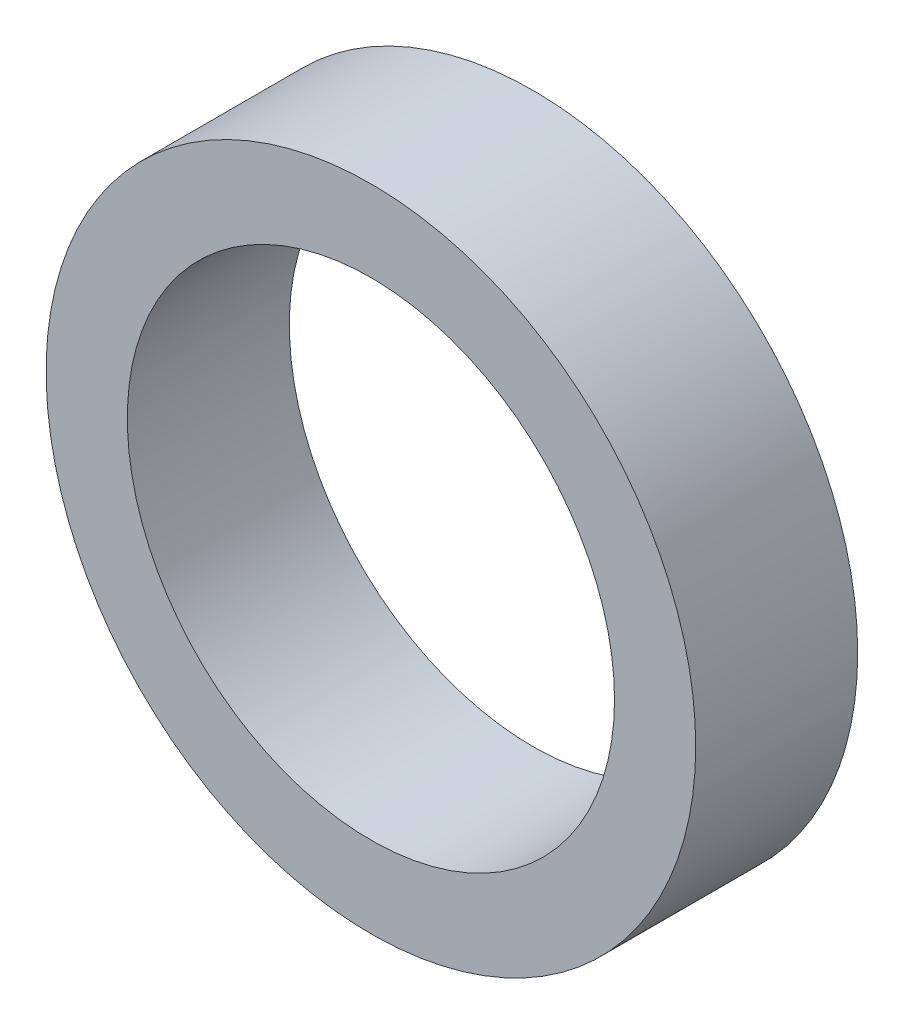
ISO-10303-21;
HEADER;
FILE_DESCRIPTION(('STEP AP214'),'2;1');
FILE_NAME('part.step','',(''),(''),'','','');
FILE_SCHEMA(('AUTOMOTIVE_DESIGN { 1 0 10303 214 1 1 1 1 }'));
ENDSEC;
DATA;
#1=APPLICATION_CONTEXT('core data for automotive mechanical design processes');
#2=APPLICATION_PROTOCOL_DEFINITION('international standard','automotive_design',2000,#1);
#3=PRODUCT_CONTEXT('',#1,'mechanical');
#4=PRODUCT('Part','Part','',(#3));
#5=PRODUCT_RELATED_PRODUCT_CATEGORY('part','',(#4));
#6=PRODUCT_DEFINITION_FORMATION('','',#4);
#7=PRODUCT_DEFINITION_CONTEXT('part definition',#1,'design');
#8=PRODUCT_DEFINITION('design','',#6,#7);
#9=PRODUCT_DEFINITION_SHAPE('','',#8);
#10=(LENGTH_UNIT() NAMED_UNIT(*) SI_UNIT(.MILLI.,.METRE.));
#11=(NAMED_UNIT(*) PLANE_ANGLE_UNIT() SI_UNIT($,.RADIAN.));
#12=(NAMED_UNIT(*) SI_UNIT($,.STERADIAN.) SOLID_ANGLE_UNIT());
#13=UNCERTAINTY_MEASURE_WITH_UNIT(LENGTH_MEASURE(1.E-05),#10,'distance_accuracy_value','');
#14=(GEOMETRIC_REPRESENTATION_CONTEXT(3) GLOBAL_UNCERTAINTY_ASSIGNED_CONTEXT((#13)) GLOBAL_UNIT_ASSIGNED_CONTEXT((#10,
#11,#12)) REPRESENTATION_CONTEXT('',''));
#15=CARTESIAN_POINT('',(0.,0.,0.));
#16=DIRECTION('',(0.,0.,1.));
#17=DIRECTION('',(1.,0.,0.));
#18=AXIS2_PLACEMENT_3D('',#15,#16,#17);
#19=CARTESIAN_POINT('',(0.,0.,3.16652148));
#20=DIRECTION('',(0.,0.,1.));
#21=DIRECTION('',(1.,0.,0.));
#22=AXIS2_PLACEMENT_3D('',#19,#20,#21);
#23=PLANE('',#22);
#24=CARTESIAN_POINT('',(0.,0.,3.16652148));
#25=DIRECTION('',(0.,0.,1.));
#26=DIRECTION('',(1.,0.,0.));
#27=AXIS2_PLACEMENT_3D('',#24,#25,#26);
#28=CIRCLE('',#27,6.35);
#29=CARTESIAN_POINT('',(6.35,0.,3.16652148));
#30=VERTEX_POINT('',#29);
#31=EDGE_CURVE('E10',#30,#30,#28,.T.);
#32=ORIENTED_EDGE('',*,*,#31,.T.);
#33=EDGE_LOOP('',(#32));
#34=FACE_BOUND('',#33,.T.);
#35=CARTESIAN_POINT('',(0.,0.,3.16652148));
#36=DIRECTION('',(0.,0.,1.));
#37=DIRECTION('',(1.,0.,0.));
#38=AXIS2_PLACEMENT_3D('',#35,#36,#37);
#39=CIRCLE('',#38,4.7625);
#40=CARTESIAN_POINT('',(4.7625,0.,3.16652148));
#41=VERTEX_POINT('',#40);
#42=EDGE_CURVE('E42',#41,#41,#39,.T.);
#43=ORIENTED_EDGE('',*,*,#42,.F.);
#44=EDGE_LOOP('',(#43));
#45=FACE_BOUND('',#44,.T.);
#46=ADVANCED_FACE('F31',(#34,#45),#23,.T.);
#47=CARTESIAN_POINT('',(0.,0.,0.));
#48=DIRECTION('',(0.,0.,1.));
#49=DIRECTION('',(1.,0.,0.));
#50=AXIS2_PLACEMENT_3D('',#47,#48,#49);
#51=PLANE('',#50);
#52=CARTESIAN_POINT('',(0.,0.,0.));
#53=DIRECTION('',(0.,0.,1.));
#54=DIRECTION('',(1.,0.,0.));
#55=AXIS2_PLACEMENT_3D('',#52,#53,#54);
#56=CIRCLE('',#55,6.35);
#57=CARTESIAN_POINT('',(6.35,0.,0.));
#58=VERTEX_POINT('',#57);
#59=EDGE_CURVE('E35',#58,#58,#56,.T.);
#60=ORIENTED_EDGE('',*,*,#59,.F.);
#61=EDGE_LOOP('',(#60));
#62=FACE_BOUND('',#61,.T.);
#63=CARTESIAN_POINT('',(0.,0.,0.));
#64=DIRECTION('',(0.,0.,1.));
#65=DIRECTION('',(1.,0.,0.));
#66=AXIS2_PLACEMENT_3D('',#63,#64,#65);
#67=CIRCLE('',#66,4.7625);
#68=CARTESIAN_POINT('',(4.7625,0.,0.));
#69=VERTEX_POINT('',#68);
#70=EDGE_CURVE('E44',#69,#69,#67,.T.);
#71=ORIENTED_EDGE('',*,*,#70,.T.);
#72=EDGE_LOOP('',(#71));
#73=FACE_BOUND('',#72,.T.);
#74=ADVANCED_FACE('F54',(#62,#73),#51,.F.);
#75=CARTESIAN_POINT('',(0.,0.,3.16652148));
#76=DIRECTION('',(0.,0.,-1.));
#77=DIRECTION('',(-1.,0.,0.));
#78=AXIS2_PLACEMENT_3D('',#75,#76,#77);
#79=CYLINDRICAL_SURFACE('',#78,6.35);
#80=ORIENTED_EDGE('',*,*,#31,.F.);
#81=EDGE_LOOP('',(#80));
#82=FACE_BOUND('',#81,.T.);
#83=ORIENTED_EDGE('',*,*,#59,.T.);
#84=EDGE_LOOP('',(#83));
#85=FACE_BOUND('',#84,.T.);
#86=ADVANCED_FACE('F33',(#82,#85),#79,.T.);
#87=CARTESIAN_POINT('',(0.,0.,3.16652148));
#88=DIRECTION('',(0.,0.,-1.));
#89=DIRECTION('',(-1.,0.,0.));
#90=AXIS2_PLACEMENT_3D('',#87,#88,#89);
#91=CYLINDRICAL_SURFACE('',#90,4.7625);
#92=ORIENTED_EDGE('',*,*,#42,.T.);
#93=EDGE_LOOP('',(#92));
#94=FACE_BOUND('',#93,.T.);
#95=ORIENTED_EDGE('',*,*,#70,.F.);
#96=EDGE_LOOP('',(#95));
#97=FACE_BOUND('',#96,.T.);
#98=ADVANCED_FACE('F50',(#94,#97),#91,.F.);
#99=CLOSED_SHELL('',(#46,#74,#86,#98));
#100=MANIFOLD_SOLID_BREP('B2',#99);
#101=ADVANCED_BREP_SHAPE_REPRESENTATION('',(#18,#100),#14);
#102=SHAPE_DEFINITION_REPRESENTATION(#9,#101);
ENDSEC;
END-ISO-10303-21;
